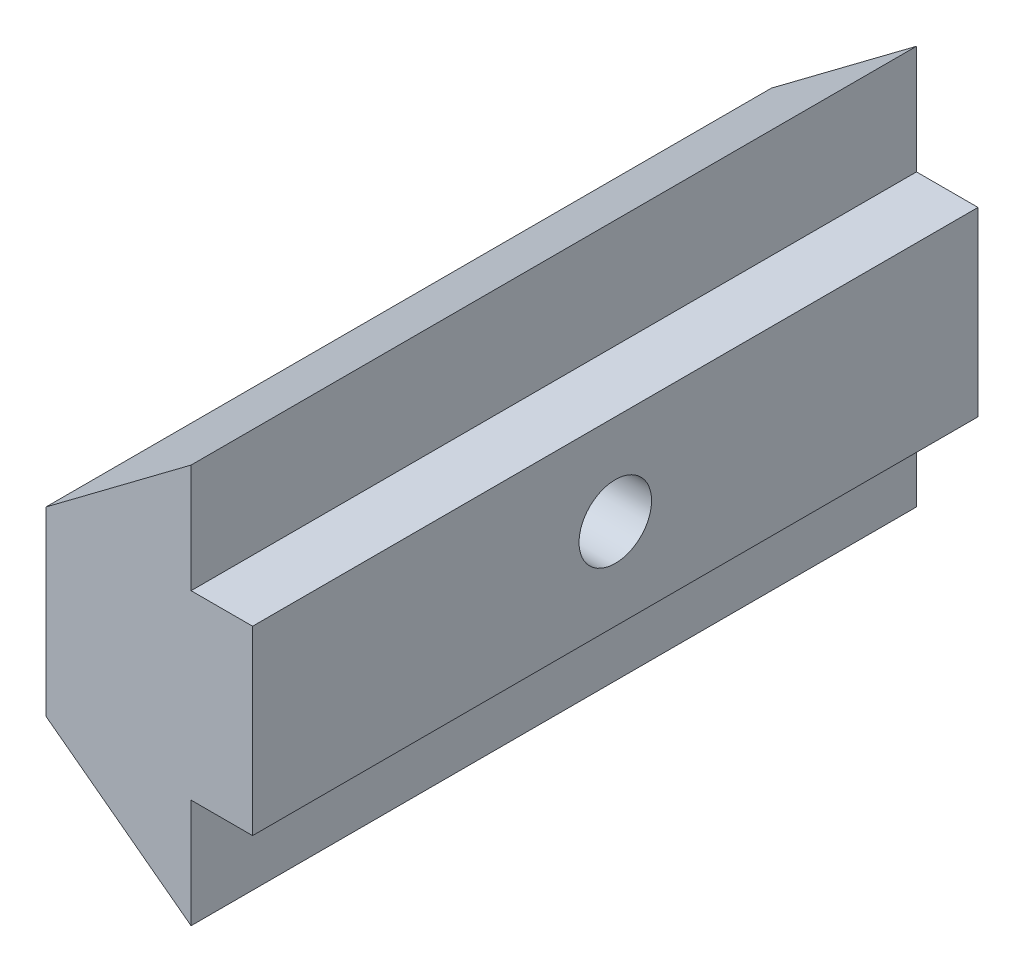
ISO-10303-21;
HEADER;
FILE_DESCRIPTION(('STEP AP214'),'2;1');
FILE_NAME('part.step','',(''),(''),'','','');
FILE_SCHEMA(('AUTOMOTIVE_DESIGN { 1 0 10303 214 1 1 1 1 }'));
ENDSEC;
DATA;
#1=APPLICATION_CONTEXT('core data for automotive mechanical design processes');
#2=APPLICATION_PROTOCOL_DEFINITION('international standard','automotive_design',2000,#1);
#3=PRODUCT_CONTEXT('',#1,'mechanical');
#4=PRODUCT('Part','Part','',(#3));
#5=PRODUCT_RELATED_PRODUCT_CATEGORY('part','',(#4));
#6=PRODUCT_DEFINITION_FORMATION('','',#4);
#7=PRODUCT_DEFINITION_CONTEXT('part definition',#1,'design');
#8=PRODUCT_DEFINITION('design','',#6,#7);
#9=PRODUCT_DEFINITION_SHAPE('','',#8);
#10=(LENGTH_UNIT() NAMED_UNIT(*) SI_UNIT(.MILLI.,.METRE.));
#11=(NAMED_UNIT(*) PLANE_ANGLE_UNIT() SI_UNIT($,.RADIAN.));
#12=(NAMED_UNIT(*) SI_UNIT($,.STERADIAN.) SOLID_ANGLE_UNIT());
#13=UNCERTAINTY_MEASURE_WITH_UNIT(LENGTH_MEASURE(1.E-05),#10,'distance_accuracy_value','');
#14=(GEOMETRIC_REPRESENTATION_CONTEXT(3) GLOBAL_UNCERTAINTY_ASSIGNED_CONTEXT((#13)) GLOBAL_UNIT_ASSIGNED_CONTEXT((#10,
#11,#12)) REPRESENTATION_CONTEXT('',''));
#15=CARTESIAN_POINT('',(0.,0.,0.));
#16=DIRECTION('',(0.,0.,1.));
#17=DIRECTION('',(1.,0.,0.));
#18=AXIS2_PLACEMENT_3D('',#15,#16,#17);
#19=CARTESIAN_POINT('',(0.,0.,20.));
#20=DIRECTION('',(0.6,0.8,0.));
#21=DIRECTION('',(-0.8,0.6,0.));
#22=AXIS2_PLACEMENT_3D('',#19,#20,#21);
#23=PLANE('',#22);
#24=DIRECTION('',(0.8,-0.6,0.));
#25=VECTOR('',#24,1.);
#26=CARTESIAN_POINT('',(0.,0.,0.));
#27=LINE('',#26,#25);
#28=CARTESIAN_POINT('',(0.,0.,0.));
#29=VERTEX_POINT('',#28);
#30=CARTESIAN_POINT('',(4.,-3.,0.));
#31=VERTEX_POINT('',#30);
#32=EDGE_CURVE('E128',#29,#31,#27,.T.);
#33=ORIENTED_EDGE('',*,*,#32,.T.);
#34=DIRECTION('',(0.,0.,-1.));
#35=VECTOR('',#34,1.);
#36=CARTESIAN_POINT('',(4.,-3.,20.));
#37=LINE('',#36,#35);
#38=CARTESIAN_POINT('',(4.,-3.,20.));
#39=VERTEX_POINT('',#38);
#40=EDGE_CURVE('E11',#39,#31,#37,.T.);
#41=ORIENTED_EDGE('',*,*,#40,.F.);
#42=DIRECTION('',(0.8,-0.6,0.));
#43=VECTOR('',#42,1.);
#44=CARTESIAN_POINT('',(0.,0.,20.));
#45=LINE('',#44,#43);
#46=CARTESIAN_POINT('',(0.,0.,20.));
#47=VERTEX_POINT('',#46);
#48=EDGE_CURVE('E143',#47,#39,#45,.T.);
#49=ORIENTED_EDGE('',*,*,#48,.F.);
#50=DIRECTION('',(0.,0.,-1.));
#51=VECTOR('',#50,1.);
#52=CARTESIAN_POINT('',(0.,0.,20.));
#53=LINE('',#52,#51);
#54=EDGE_CURVE('E124',#47,#29,#53,.T.);
#55=ORIENTED_EDGE('',*,*,#54,.T.);
#56=EDGE_LOOP('',(#33,#41,#49,#55));
#57=FACE_BOUND('',#56,.T.);
#58=ADVANCED_FACE('F32',(#57),#23,.F.);
#59=CARTESIAN_POINT('',(4.,0.,20.));
#60=DIRECTION('',(-1.,0.,0.));
#61=DIRECTION('',(0.,0.,1.));
#62=AXIS2_PLACEMENT_3D('',#59,#60,#61);
#63=PLANE('',#62);
#64=DIRECTION('',(0.,1.,0.));
#65=VECTOR('',#64,1.);
#66=CARTESIAN_POINT('',(4.,0.,0.));
#67=LINE('',#66,#65);
#68=CARTESIAN_POINT('',(4.,0.,0.));
#69=VERTEX_POINT('',#68);
#70=EDGE_CURVE('E131',#31,#69,#67,.T.);
#71=ORIENTED_EDGE('',*,*,#70,.T.);
#72=DIRECTION('',(0.,0.,-1.));
#73=VECTOR('',#72,1.);
#74=CARTESIAN_POINT('',(4.,0.,20.));
#75=LINE('',#74,#73);
#76=CARTESIAN_POINT('',(4.,0.,20.));
#77=VERTEX_POINT('',#76);
#78=EDGE_CURVE('E40',#77,#69,#75,.T.);
#79=ORIENTED_EDGE('',*,*,#78,.F.);
#80=DIRECTION('',(0.,1.,0.));
#81=VECTOR('',#80,1.);
#82=CARTESIAN_POINT('',(4.,0.,20.));
#83=LINE('',#82,#81);
#84=EDGE_CURVE('E91',#39,#77,#83,.T.);
#85=ORIENTED_EDGE('',*,*,#84,.F.);
#86=ORIENTED_EDGE('',*,*,#40,.T.);
#87=EDGE_LOOP('',(#71,#79,#85,#86));
#88=FACE_BOUND('',#87,.T.);
#89=ADVANCED_FACE('F197',(#88),#63,.F.);
#90=CARTESIAN_POINT('',(5.69584116590784,0.,20.));
#91=DIRECTION('',(0.,1.,0.));
#92=DIRECTION('',(0.,0.,1.));
#93=AXIS2_PLACEMENT_3D('',#90,#91,#92);
#94=PLANE('',#93);
#95=DIRECTION('',(1.,0.,0.));
#96=VECTOR('',#95,1.);
#97=CARTESIAN_POINT('',(5.69584116590784,0.,0.));
#98=LINE('',#97,#96);
#99=CARTESIAN_POINT('',(5.69584116590784,0.,0.));
#100=VERTEX_POINT('',#99);
#101=EDGE_CURVE('E134',#69,#100,#98,.T.);
#102=ORIENTED_EDGE('',*,*,#101,.T.);
#103=DIRECTION('',(0.,0.,-1.));
#104=VECTOR('',#103,1.);
#105=CARTESIAN_POINT('',(5.69584116590784,0.,20.));
#106=LINE('',#105,#104);
#107=CARTESIAN_POINT('',(5.69584116590784,0.,20.));
#108=VERTEX_POINT('',#107);
#109=EDGE_CURVE('E150',#108,#100,#106,.T.);
#110=ORIENTED_EDGE('',*,*,#109,.F.);
#111=DIRECTION('',(1.,0.,0.));
#112=VECTOR('',#111,1.);
#113=CARTESIAN_POINT('',(5.69584116590784,0.,20.));
#114=LINE('',#113,#112);
#115=EDGE_CURVE('E158',#77,#108,#114,.T.);
#116=ORIENTED_EDGE('',*,*,#115,.F.);
#117=ORIENTED_EDGE('',*,*,#78,.T.);
#118=EDGE_LOOP('',(#102,#110,#116,#117));
#119=FACE_BOUND('',#118,.T.);
#120=ADVANCED_FACE('F156',(#119),#94,.F.);
#121=CARTESIAN_POINT('',(5.69584116590784,5.,20.));
#122=DIRECTION('',(-1.,0.,0.));
#123=DIRECTION('',(0.,0.,1.));
#124=AXIS2_PLACEMENT_3D('',#121,#122,#123);
#125=PLANE('',#124);
#126=CARTESIAN_POINT('',(5.69584116590784,2.5,10.));
#127=DIRECTION('',(1.,0.,0.));
#128=DIRECTION('',(0.,0.,-1.));
#129=AXIS2_PLACEMENT_3D('',#126,#127,#128);
#130=CIRCLE('',#129,1.);
#131=CARTESIAN_POINT('',(5.69584116590784,2.5,9.));
#132=VERTEX_POINT('',#131);
#133=EDGE_CURVE('E176',#132,#132,#130,.T.);
#134=ORIENTED_EDGE('',*,*,#133,.F.);
#135=EDGE_LOOP('',(#134));
#136=FACE_BOUND('',#135,.T.);
#137=DIRECTION('',(0.,1.,0.));
#138=VECTOR('',#137,1.);
#139=CARTESIAN_POINT('',(5.69584116590784,5.,0.));
#140=LINE('',#139,#138);
#141=CARTESIAN_POINT('',(5.69584116590784,5.,0.));
#142=VERTEX_POINT('',#141);
#143=EDGE_CURVE('E136',#100,#142,#140,.T.);
#144=ORIENTED_EDGE('',*,*,#143,.T.);
#145=DIRECTION('',(0.,0.,-1.));
#146=VECTOR('',#145,1.);
#147=CARTESIAN_POINT('',(5.69584116590784,5.,20.));
#148=LINE('',#147,#146);
#149=CARTESIAN_POINT('',(5.69584116590784,5.,20.));
#150=VERTEX_POINT('',#149);
#151=EDGE_CURVE('E147',#150,#142,#148,.T.);
#152=ORIENTED_EDGE('',*,*,#151,.F.);
#153=DIRECTION('',(0.,1.,0.));
#154=VECTOR('',#153,1.);
#155=CARTESIAN_POINT('',(5.69584116590784,5.,20.));
#156=LINE('',#155,#154);
#157=EDGE_CURVE('E170',#108,#150,#156,.T.);
#158=ORIENTED_EDGE('',*,*,#157,.F.);
#159=ORIENTED_EDGE('',*,*,#109,.T.);
#160=EDGE_LOOP('',(#144,#152,#158,#159));
#161=FACE_BOUND('',#160,.T.);
#162=ADVANCED_FACE('F166',(#136,#161),#125,.F.);
#163=CARTESIAN_POINT('',(4.,5.,20.));
#164=DIRECTION('',(0.,-1.,0.));
#165=DIRECTION('',(0.,0.,-1.));
#166=AXIS2_PLACEMENT_3D('',#163,#164,#165);
#167=PLANE('',#166);
#168=DIRECTION('',(-1.,0.,0.));
#169=VECTOR('',#168,1.);
#170=CARTESIAN_POINT('',(4.,5.,0.));
#171=LINE('',#170,#169);
#172=CARTESIAN_POINT('',(4.,5.,0.));
#173=VERTEX_POINT('',#172);
#174=EDGE_CURVE('E138',#142,#173,#171,.T.);
#175=ORIENTED_EDGE('',*,*,#174,.T.);
#176=DIRECTION('',(0.,0.,-1.));
#177=VECTOR('',#176,1.);
#178=CARTESIAN_POINT('',(4.,5.,20.));
#179=LINE('',#178,#177);
#180=CARTESIAN_POINT('',(4.,5.,20.));
#181=VERTEX_POINT('',#180);
#182=EDGE_CURVE('E119',#181,#173,#179,.T.);
#183=ORIENTED_EDGE('',*,*,#182,.F.);
#184=DIRECTION('',(-1.,0.,0.));
#185=VECTOR('',#184,1.);
#186=CARTESIAN_POINT('',(4.,5.,20.));
#187=LINE('',#186,#185);
#188=EDGE_CURVE('E110',#150,#181,#187,.T.);
#189=ORIENTED_EDGE('',*,*,#188,.F.);
#190=ORIENTED_EDGE('',*,*,#151,.T.);
#191=EDGE_LOOP('',(#175,#183,#189,#190));
#192=FACE_BOUND('',#191,.T.);
#193=ADVANCED_FACE('F169',(#192),#167,.F.);
#194=CARTESIAN_POINT('',(4.,8.,20.));
#195=DIRECTION('',(-1.,0.,0.));
#196=DIRECTION('',(0.,0.,1.));
#197=AXIS2_PLACEMENT_3D('',#194,#195,#196);
#198=PLANE('',#197);
#199=DIRECTION('',(0.,1.,0.));
#200=VECTOR('',#199,1.);
#201=CARTESIAN_POINT('',(4.,8.,0.));
#202=LINE('',#201,#200);
#203=CARTESIAN_POINT('',(4.,8.,0.));
#204=VERTEX_POINT('',#203);
#205=EDGE_CURVE('E118',#173,#204,#202,.T.);
#206=ORIENTED_EDGE('',*,*,#205,.T.);
#207=DIRECTION('',(0.,0.,-1.));
#208=VECTOR('',#207,1.);
#209=CARTESIAN_POINT('',(4.,8.,20.));
#210=LINE('',#209,#208);
#211=CARTESIAN_POINT('',(4.,8.,20.));
#212=VERTEX_POINT('',#211);
#213=EDGE_CURVE('E115',#212,#204,#210,.T.);
#214=ORIENTED_EDGE('',*,*,#213,.F.);
#215=DIRECTION('',(0.,1.,0.));
#216=VECTOR('',#215,1.);
#217=CARTESIAN_POINT('',(4.,8.,20.));
#218=LINE('',#217,#216);
#219=EDGE_CURVE('E104',#181,#212,#218,.T.);
#220=ORIENTED_EDGE('',*,*,#219,.F.);
#221=ORIENTED_EDGE('',*,*,#182,.T.);
#222=EDGE_LOOP('',(#206,#214,#220,#221));
#223=FACE_BOUND('',#222,.T.);
#224=ADVANCED_FACE('F116',(#223),#198,.F.);
#225=CARTESIAN_POINT('',(0.,5.,20.));
#226=DIRECTION('',(0.6,-0.8,0.));
#227=DIRECTION('',(0.8,0.6,0.));
#228=AXIS2_PLACEMENT_3D('',#225,#226,#227);
#229=PLANE('',#228);
#230=DIRECTION('',(-0.8,-0.6,0.));
#231=VECTOR('',#230,1.);
#232=CARTESIAN_POINT('',(0.,5.,0.));
#233=LINE('',#232,#231);
#234=CARTESIAN_POINT('',(0.,5.,0.));
#235=VERTEX_POINT('',#234);
#236=EDGE_CURVE('E77',#204,#235,#233,.T.);
#237=ORIENTED_EDGE('',*,*,#236,.T.);
#238=DIRECTION('',(0.,0.,-1.));
#239=VECTOR('',#238,1.);
#240=CARTESIAN_POINT('',(0.,5.,20.));
#241=LINE('',#240,#239);
#242=CARTESIAN_POINT('',(0.,5.,20.));
#243=VERTEX_POINT('',#242);
#244=EDGE_CURVE('E120',#243,#235,#241,.T.);
#245=ORIENTED_EDGE('',*,*,#244,.F.);
#246=DIRECTION('',(-0.8,-0.6,0.));
#247=VECTOR('',#246,1.);
#248=CARTESIAN_POINT('',(0.,5.,20.));
#249=LINE('',#248,#247);
#250=EDGE_CURVE('E108',#212,#243,#249,.T.);
#251=ORIENTED_EDGE('',*,*,#250,.F.);
#252=ORIENTED_EDGE('',*,*,#213,.T.);
#253=EDGE_LOOP('',(#237,#245,#251,#252));
#254=FACE_BOUND('',#253,.T.);
#255=ADVANCED_FACE('F122',(#254),#229,.F.);
#256=CARTESIAN_POINT('',(0.,0.,20.));
#257=DIRECTION('',(1.,0.,0.));
#258=DIRECTION('',(0.,0.,-1.));
#259=AXIS2_PLACEMENT_3D('',#256,#257,#258);
#260=PLANE('',#259);
#261=CARTESIAN_POINT('',(0.,2.5,10.));
#262=DIRECTION('',(1.,0.,0.));
#263=DIRECTION('',(0.,0.,-1.));
#264=AXIS2_PLACEMENT_3D('',#261,#262,#263);
#265=CIRCLE('',#264,1.);
#266=CARTESIAN_POINT('',(0.,2.5,9.));
#267=VERTEX_POINT('',#266);
#268=EDGE_CURVE('E132',#267,#267,#265,.T.);
#269=ORIENTED_EDGE('',*,*,#268,.T.);
#270=EDGE_LOOP('',(#269));
#271=FACE_BOUND('',#270,.T.);
#272=DIRECTION('',(0.,-1.,0.));
#273=VECTOR('',#272,1.);
#274=CARTESIAN_POINT('',(0.,0.,0.));
#275=LINE('',#274,#273);
#276=EDGE_CURVE('E83',#235,#29,#275,.T.);
#277=ORIENTED_EDGE('',*,*,#276,.T.);
#278=ORIENTED_EDGE('',*,*,#54,.F.);
#279=DIRECTION('',(0.,-1.,0.));
#280=VECTOR('',#279,1.);
#281=CARTESIAN_POINT('',(0.,0.,20.));
#282=LINE('',#281,#280);
#283=EDGE_CURVE('E48',#243,#47,#282,.T.);
#284=ORIENTED_EDGE('',*,*,#283,.F.);
#285=ORIENTED_EDGE('',*,*,#244,.T.);
#286=EDGE_LOOP('',(#277,#278,#284,#285));
#287=FACE_BOUND('',#286,.T.);
#288=ADVANCED_FACE('F182',(#271,#287),#260,.F.);
#289=CARTESIAN_POINT('',(0.,0.,20.));
#290=DIRECTION('',(0.,0.,1.));
#291=DIRECTION('',(1.,0.,0.));
#292=AXIS2_PLACEMENT_3D('',#289,#290,#291);
#293=PLANE('',#292);
#294=ORIENTED_EDGE('',*,*,#48,.T.);
#295=ORIENTED_EDGE('',*,*,#84,.T.);
#296=ORIENTED_EDGE('',*,*,#115,.T.);
#297=ORIENTED_EDGE('',*,*,#157,.T.);
#298=ORIENTED_EDGE('',*,*,#188,.T.);
#299=ORIENTED_EDGE('',*,*,#219,.T.);
#300=ORIENTED_EDGE('',*,*,#250,.T.);
#301=ORIENTED_EDGE('',*,*,#283,.T.);
#302=EDGE_LOOP('',(#294,#295,#296,#297,#298,#299,#300,#301));
#303=FACE_BOUND('',#302,.T.);
#304=ADVANCED_FACE('F106',(#303),#293,.T.);
#305=CARTESIAN_POINT('',(0.,0.,0.));
#306=DIRECTION('',(0.,0.,1.));
#307=DIRECTION('',(1.,0.,0.));
#308=AXIS2_PLACEMENT_3D('',#305,#306,#307);
#309=PLANE('',#308);
#310=ORIENTED_EDGE('',*,*,#32,.F.);
#311=ORIENTED_EDGE('',*,*,#276,.F.);
#312=ORIENTED_EDGE('',*,*,#236,.F.);
#313=ORIENTED_EDGE('',*,*,#205,.F.);
#314=ORIENTED_EDGE('',*,*,#174,.F.);
#315=ORIENTED_EDGE('',*,*,#143,.F.);
#316=ORIENTED_EDGE('',*,*,#101,.F.);
#317=ORIENTED_EDGE('',*,*,#70,.F.);
#318=EDGE_LOOP('',(#310,#311,#312,#313,#314,#315,#316,#317));
#319=FACE_BOUND('',#318,.T.);
#320=ADVANCED_FACE('F162',(#319),#309,.F.);
#321=CARTESIAN_POINT('',(0.,2.5,10.));
#322=DIRECTION('',(1.,0.,0.));
#323=DIRECTION('',(0.,0.,-1.));
#324=AXIS2_PLACEMENT_3D('',#321,#322,#323);
#325=CYLINDRICAL_SURFACE('',#324,1.);
#326=ORIENTED_EDGE('',*,*,#268,.F.);
#327=EDGE_LOOP('',(#326));
#328=FACE_BOUND('',#327,.T.);
#329=ORIENTED_EDGE('',*,*,#133,.T.);
#330=EDGE_LOOP('',(#329));
#331=FACE_BOUND('',#330,.T.);
#332=ADVANCED_FACE('F184',(#328,#331),#325,.F.);
#333=CLOSED_SHELL('',(#58,#89,#120,#162,#193,#224,#255,#288,#304,#320,#332));
#334=MANIFOLD_SOLID_BREP('B2',#333);
#335=ADVANCED_BREP_SHAPE_REPRESENTATION('',(#18,#334),#14);
#336=SHAPE_DEFINITION_REPRESENTATION(#9,#335);
ENDSEC;
END-ISO-10303-21;
